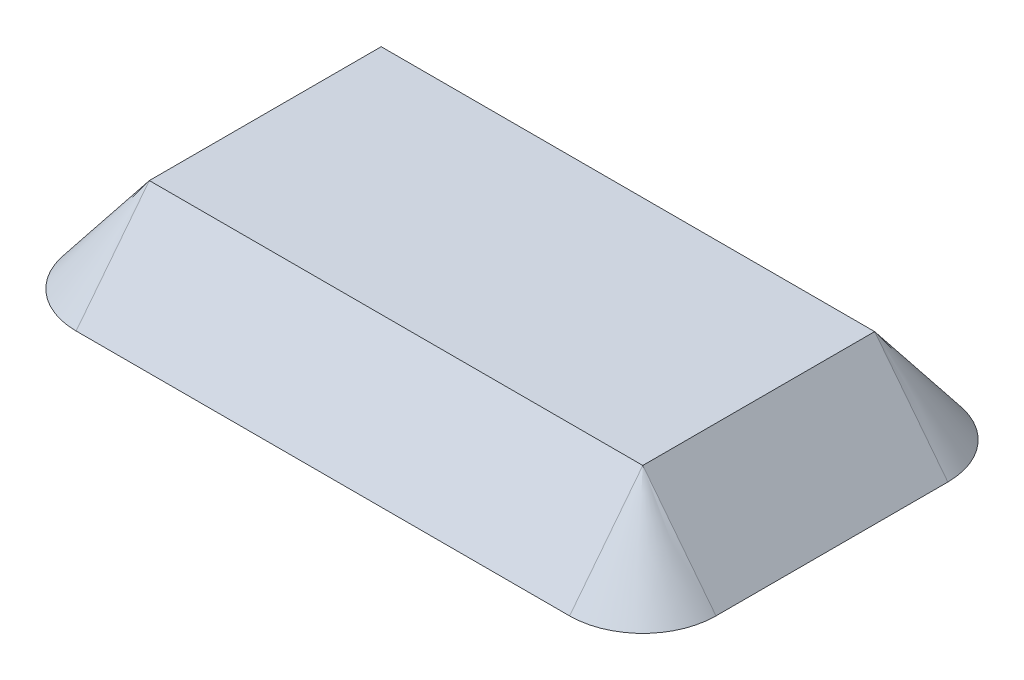
ISO-10303-21;
HEADER;
FILE_DESCRIPTION(('STEP AP214'),'2;1');
FILE_NAME('part.step','',(''),(''),'','','');
FILE_SCHEMA(('AUTOMOTIVE_DESIGN { 1 0 10303 214 1 1 1 1 }'));
ENDSEC;
DATA;
#1=APPLICATION_CONTEXT('core data for automotive mechanical design processes');
#2=APPLICATION_PROTOCOL_DEFINITION('international standard','automotive_design',2000,#1);
#3=PRODUCT_CONTEXT('',#1,'mechanical');
#4=PRODUCT('Part','Part','',(#3));
#5=PRODUCT_RELATED_PRODUCT_CATEGORY('part','',(#4));
#6=PRODUCT_DEFINITION_FORMATION('','',#4);
#7=PRODUCT_DEFINITION_CONTEXT('part definition',#1,'design');
#8=PRODUCT_DEFINITION('design','',#6,#7);
#9=PRODUCT_DEFINITION_SHAPE('','',#8);
#10=(LENGTH_UNIT() NAMED_UNIT(*) SI_UNIT(.MILLI.,.METRE.));
#11=(NAMED_UNIT(*) PLANE_ANGLE_UNIT() SI_UNIT($,.RADIAN.));
#12=(NAMED_UNIT(*) SI_UNIT($,.STERADIAN.) SOLID_ANGLE_UNIT());
#13=UNCERTAINTY_MEASURE_WITH_UNIT(LENGTH_MEASURE(1.E-05),#10,'distance_accuracy_value','');
#14=(GEOMETRIC_REPRESENTATION_CONTEXT(3) GLOBAL_UNCERTAINTY_ASSIGNED_CONTEXT((#13)) GLOBAL_UNIT_ASSIGNED_CONTEXT((#10,
#11,#12)) REPRESENTATION_CONTEXT('',''));
#15=CARTESIAN_POINT('',(0.,0.,0.));
#16=DIRECTION('',(0.,0.,1.));
#17=DIRECTION('',(1.,0.,0.));
#18=AXIS2_PLACEMENT_3D('',#15,#16,#17);
#19=CARTESIAN_POINT('',(0.,0.,0.));
#20=DIRECTION('',(0.,-1.,0.));
#21=DIRECTION('',(0.,0.,-1.));
#22=AXIS2_PLACEMENT_3D('',#19,#20,#21);
#23=PLANE('',#22);
#24=DIRECTION('',(0.,0.,-1.));
#25=VECTOR('',#24,1.);
#26=CARTESIAN_POINT('',(102.25,0.,-47.25));
#27=LINE('',#26,#25);
#28=CARTESIAN_POINT('',(102.25,0.,47.25));
#29=VERTEX_POINT('',#28);
#30=CARTESIAN_POINT('',(102.25,0.,10.));
#31=VERTEX_POINT('',#30);
#32=EDGE_CURVE('E537',#29,#31,#27,.T.);
#33=ORIENTED_EDGE('',*,*,#32,.T.);
#34=DIRECTION('',(1.,0.,0.));
#35=VECTOR('',#34,1.);
#36=CARTESIAN_POINT('',(0.,0.,10.));
#37=LINE('',#36,#35);
#38=CARTESIAN_POINT('',(103.75,0.,10.));
#39=VERTEX_POINT('',#38);
#40=EDGE_CURVE('E50',#31,#39,#37,.T.);
#41=ORIENTED_EDGE('',*,*,#40,.T.);
#42=DIRECTION('',(0.,0.,-1.));
#43=VECTOR('',#42,1.);
#44=CARTESIAN_POINT('',(103.75,0.,-48.75));
#45=LINE('',#44,#43);
#46=CARTESIAN_POINT('',(103.75,0.,48.75));
#47=VERTEX_POINT('',#46);
#48=EDGE_CURVE('E566',#47,#39,#45,.T.);
#49=ORIENTED_EDGE('',*,*,#48,.F.);
#50=DIRECTION('',(1.,0.,0.));
#51=VECTOR('',#50,1.);
#52=CARTESIAN_POINT('',(103.75,0.,48.75));
#53=LINE('',#52,#51);
#54=CARTESIAN_POINT('',(-103.75,0.,48.75));
#55=VERTEX_POINT('',#54);
#56=EDGE_CURVE('E561',#55,#47,#53,.T.);
#57=ORIENTED_EDGE('',*,*,#56,.F.);
#58=DIRECTION('',(0.,0.,1.));
#59=VECTOR('',#58,1.);
#60=CARTESIAN_POINT('',(-103.75,0.,-48.75));
#61=LINE('',#60,#59);
#62=CARTESIAN_POINT('',(-103.75,0.,10.));
#63=VERTEX_POINT('',#62);
#64=EDGE_CURVE('E556',#63,#55,#61,.T.);
#65=ORIENTED_EDGE('',*,*,#64,.F.);
#66=DIRECTION('',(-1.,0.,0.));
#67=VECTOR('',#66,1.);
#68=CARTESIAN_POINT('',(0.,0.,10.));
#69=LINE('',#68,#67);
#70=CARTESIAN_POINT('',(-102.25,0.,10.));
#71=VERTEX_POINT('',#70);
#72=EDGE_CURVE('E64',#71,#63,#69,.T.);
#73=ORIENTED_EDGE('',*,*,#72,.F.);
#74=DIRECTION('',(0.,0.,1.));
#75=VECTOR('',#74,1.);
#76=CARTESIAN_POINT('',(-102.25,0.,-47.25));
#77=LINE('',#76,#75);
#78=CARTESIAN_POINT('',(-102.25,0.,47.25));
#79=VERTEX_POINT('',#78);
#80=EDGE_CURVE('E519',#71,#79,#77,.T.);
#81=ORIENTED_EDGE('',*,*,#80,.T.);
#82=DIRECTION('',(1.,0.,0.));
#83=VECTOR('',#82,1.);
#84=CARTESIAN_POINT('',(102.25,0.,47.25));
#85=LINE('',#84,#83);
#86=EDGE_CURVE('E532',#79,#29,#85,.T.);
#87=ORIENTED_EDGE('',*,*,#86,.T.);
#88=EDGE_LOOP('',(#33,#41,#49,#57,#65,#73,#81,#87));
#89=FACE_BOUND('',#88,.T.);
#90=ADVANCED_FACE('F41',(#89),#23,.T.);
#91=CARTESIAN_POINT('',(-102.25,25.,-47.25));
#92=DIRECTION('',(1.,0.,0.));
#93=DIRECTION('',(0.,0.,-1.));
#94=AXIS2_PLACEMENT_3D('',#91,#92,#93);
#95=PLANE('',#94);
#96=DIRECTION('',(0.,1.,0.));
#97=VECTOR('',#96,1.);
#98=CARTESIAN_POINT('',(-102.25,10.,10.));
#99=LINE('',#98,#97);
#100=CARTESIAN_POINT('',(-102.25,-10.,10.));
#101=VERTEX_POINT('',#100);
#102=EDGE_CURVE('E299',#101,#71,#99,.T.);
#103=ORIENTED_EDGE('',*,*,#102,.F.);
#104=CARTESIAN_POINT('',(-102.25,-10.,0.));
#105=DIRECTION('',(1.,0.,0.));
#106=DIRECTION('',(0.,0.,-1.));
#107=AXIS2_PLACEMENT_3D('',#104,#105,#106);
#108=CIRCLE('',#107,10.);
#109=CARTESIAN_POINT('',(-102.25,-10.,-9.99999999999999));
#110=VERTEX_POINT('',#109);
#111=EDGE_CURVE('E288',#101,#110,#108,.F.);
#112=ORIENTED_EDGE('',*,*,#111,.T.);
#113=DIRECTION('',(0.,-1.,0.));
#114=VECTOR('',#113,1.);
#115=CARTESIAN_POINT('',(-102.25,10.,-9.99999999999999));
#116=LINE('',#115,#114);
#117=CARTESIAN_POINT('',(-102.25,0.,-9.99999999999999));
#118=VERTEX_POINT('',#117);
#119=EDGE_CURVE('E295',#118,#110,#116,.T.);
#120=ORIENTED_EDGE('',*,*,#119,.F.);
#121=CARTESIAN_POINT('',(-102.25,0.,-47.25));
#122=VERTEX_POINT('',#121);
#123=EDGE_CURVE('E529',#122,#118,#77,.T.);
#124=ORIENTED_EDGE('',*,*,#123,.F.);
#125=DIRECTION('',(0.,-1.,0.));
#126=VECTOR('',#125,1.);
#127=CARTESIAN_POINT('',(-102.25,25.,-47.25));
#128=LINE('',#127,#126);
#129=CARTESIAN_POINT('',(-102.25,5.99999999999999,-47.25));
#130=VERTEX_POINT('',#129);
#131=EDGE_CURVE('E528',#130,#122,#128,.T.);
#132=ORIENTED_EDGE('',*,*,#131,.F.);
#133=DIRECTION('',(0.,0.,-1.));
#134=VECTOR('',#133,1.);
#135=CARTESIAN_POINT('',(-102.25,5.99999999999999,0.));
#136=LINE('',#135,#134);
#137=CARTESIAN_POINT('',(-102.25,5.99999999999999,-44.75));
#138=VERTEX_POINT('',#137);
#139=EDGE_CURVE('E325',#138,#130,#136,.T.);
#140=ORIENTED_EDGE('',*,*,#139,.F.);
#141=DIRECTION('',(0.,-1.,0.));
#142=VECTOR('',#141,1.);
#143=CARTESIAN_POINT('',(-102.25,0.,-44.75));
#144=LINE('',#143,#142);
#145=CARTESIAN_POINT('',(-102.25,25.,-44.75));
#146=VERTEX_POINT('',#145);
#147=EDGE_CURVE('E321',#146,#138,#144,.T.);
#148=ORIENTED_EDGE('',*,*,#147,.F.);
#149=DIRECTION('',(0.,0.,1.));
#150=VECTOR('',#149,1.);
#151=CARTESIAN_POINT('',(-102.25,25.,-47.25));
#152=LINE('',#151,#150);
#153=CARTESIAN_POINT('',(-102.25,25.,44.75));
#154=VERTEX_POINT('',#153);
#155=EDGE_CURVE('E520',#146,#154,#152,.T.);
#156=ORIENTED_EDGE('',*,*,#155,.T.);
#157=DIRECTION('',(0.,-1.,0.));
#158=VECTOR('',#157,1.);
#159=CARTESIAN_POINT('',(-102.25,0.,44.7499999999999));
#160=LINE('',#159,#158);
#161=CARTESIAN_POINT('',(-102.25,5.99999999999999,44.75));
#162=VERTEX_POINT('',#161);
#163=EDGE_CURVE('E348',#154,#162,#160,.T.);
#164=ORIENTED_EDGE('',*,*,#163,.T.);
#165=DIRECTION('',(0.,0.,1.));
#166=VECTOR('',#165,1.);
#167=CARTESIAN_POINT('',(-102.25,5.99999999999999,0.));
#168=LINE('',#167,#166);
#169=CARTESIAN_POINT('',(-102.25,5.99999999999999,47.25));
#170=VERTEX_POINT('',#169);
#171=EDGE_CURVE('E345',#162,#170,#168,.T.);
#172=ORIENTED_EDGE('',*,*,#171,.T.);
#173=DIRECTION('',(0.,-1.,0.));
#174=VECTOR('',#173,1.);
#175=CARTESIAN_POINT('',(-102.25,25.,47.25));
#176=LINE('',#175,#174);
#177=EDGE_CURVE('E552',#170,#79,#176,.T.);
#178=ORIENTED_EDGE('',*,*,#177,.T.);
#179=ORIENTED_EDGE('',*,*,#80,.F.);
#180=EDGE_LOOP('',(#103,#112,#120,#124,#132,#140,#148,#156,#164,#172,#178,#179));
#181=FACE_BOUND('',#180,.T.);
#182=ADVANCED_FACE('F612',(#181),#95,.T.);
#183=CARTESIAN_POINT('',(102.25,25.,-47.25));
#184=DIRECTION('',(-1.,0.,0.));
#185=DIRECTION('',(0.,0.,1.));
#186=AXIS2_PLACEMENT_3D('',#183,#184,#185);
#187=PLANE('',#186);
#188=DIRECTION('',(0.,-1.,0.));
#189=VECTOR('',#188,1.);
#190=CARTESIAN_POINT('',(102.25,0.,-10.0000000000001));
#191=LINE('',#190,#189);
#192=CARTESIAN_POINT('',(102.25,0.,-10.0000000000001));
#193=VERTEX_POINT('',#192);
#194=CARTESIAN_POINT('',(102.25,-10.,-10.0000000000001));
#195=VERTEX_POINT('',#194);
#196=EDGE_CURVE('E259',#193,#195,#191,.T.);
#197=ORIENTED_EDGE('',*,*,#196,.T.);
#198=CARTESIAN_POINT('',(102.25,-10.,0.));
#199=DIRECTION('',(-1.,0.,0.));
#200=DIRECTION('',(0.,0.,1.));
#201=AXIS2_PLACEMENT_3D('',#198,#199,#200);
#202=CIRCLE('',#201,10.);
#203=CARTESIAN_POINT('',(102.25,-10.,10.));
#204=VERTEX_POINT('',#203);
#205=EDGE_CURVE('E245',#204,#195,#202,.T.);
#206=ORIENTED_EDGE('',*,*,#205,.F.);
#207=DIRECTION('',(0.,-1.,0.));
#208=VECTOR('',#207,1.);
#209=CARTESIAN_POINT('',(102.25,0.,10.));
#210=LINE('',#209,#208);
#211=EDGE_CURVE('E252',#31,#204,#210,.T.);
#212=ORIENTED_EDGE('',*,*,#211,.F.);
#213=ORIENTED_EDGE('',*,*,#32,.F.);
#214=DIRECTION('',(0.,-1.,0.));
#215=VECTOR('',#214,1.);
#216=CARTESIAN_POINT('',(102.25,25.,47.25));
#217=LINE('',#216,#215);
#218=CARTESIAN_POINT('',(102.25,5.99999999999999,47.25));
#219=VERTEX_POINT('',#218);
#220=EDGE_CURVE('E549',#219,#29,#217,.T.);
#221=ORIENTED_EDGE('',*,*,#220,.F.);
#222=DIRECTION('',(0.,0.,-1.));
#223=VECTOR('',#222,1.);
#224=CARTESIAN_POINT('',(102.25,5.99999999999999,0.));
#225=LINE('',#224,#223);
#226=CARTESIAN_POINT('',(102.25,5.99999999999999,44.75));
#227=VERTEX_POINT('',#226);
#228=EDGE_CURVE('E356',#219,#227,#225,.T.);
#229=ORIENTED_EDGE('',*,*,#228,.T.);
#230=DIRECTION('',(0.,1.,0.));
#231=VECTOR('',#230,1.);
#232=CARTESIAN_POINT('',(102.25,0.,44.75));
#233=LINE('',#232,#231);
#234=CARTESIAN_POINT('',(102.25,25.,44.75));
#235=VERTEX_POINT('',#234);
#236=EDGE_CURVE('E329',#227,#235,#233,.T.);
#237=ORIENTED_EDGE('',*,*,#236,.T.);
#238=DIRECTION('',(0.,0.,-1.));
#239=VECTOR('',#238,1.);
#240=CARTESIAN_POINT('',(102.25,25.,-47.25));
#241=LINE('',#240,#239);
#242=CARTESIAN_POINT('',(102.25,25.,-44.75));
#243=VERTEX_POINT('',#242);
#244=EDGE_CURVE('E523',#235,#243,#241,.T.);
#245=ORIENTED_EDGE('',*,*,#244,.T.);
#246=DIRECTION('',(0.,1.,0.));
#247=VECTOR('',#246,1.);
#248=CARTESIAN_POINT('',(102.25,0.,-44.75));
#249=LINE('',#248,#247);
#250=CARTESIAN_POINT('',(102.25,5.99999999999999,-44.75));
#251=VERTEX_POINT('',#250);
#252=EDGE_CURVE('E333',#251,#243,#249,.T.);
#253=ORIENTED_EDGE('',*,*,#252,.F.);
#254=DIRECTION('',(0.,0.,1.));
#255=VECTOR('',#254,1.);
#256=CARTESIAN_POINT('',(102.25,5.99999999999999,0.));
#257=LINE('',#256,#255);
#258=CARTESIAN_POINT('',(102.25,5.99999999999999,-47.25));
#259=VERTEX_POINT('',#258);
#260=EDGE_CURVE('E320',#259,#251,#257,.T.);
#261=ORIENTED_EDGE('',*,*,#260,.F.);
#262=DIRECTION('',(0.,-1.,0.));
#263=VECTOR('',#262,1.);
#264=CARTESIAN_POINT('',(102.25,25.,-47.25));
#265=LINE('',#264,#263);
#266=CARTESIAN_POINT('',(102.25,0.,-47.25));
#267=VERTEX_POINT('',#266);
#268=EDGE_CURVE('E545',#259,#267,#265,.T.);
#269=ORIENTED_EDGE('',*,*,#268,.T.);
#270=EDGE_CURVE('E536',#193,#267,#27,.T.);
#271=ORIENTED_EDGE('',*,*,#270,.F.);
#272=EDGE_LOOP('',(#197,#206,#212,#213,#221,#229,#237,#245,#253,#261,#269,#271));
#273=FACE_BOUND('',#272,.T.);
#274=ADVANCED_FACE('F261',(#273),#187,.T.);
#275=CARTESIAN_POINT('',(102.25,25.,-47.25));
#276=DIRECTION('',(0.,0.,1.));
#277=DIRECTION('',(1.,0.,0.));
#278=AXIS2_PLACEMENT_3D('',#275,#276,#277);
#279=PLANE('',#278);
#280=ORIENTED_EDGE('',*,*,#268,.F.);
#281=DIRECTION('',(1.,0.,0.));
#282=VECTOR('',#281,1.);
#283=CARTESIAN_POINT('',(-121.413767896737,5.99999999999999,-47.25));
#284=LINE('',#283,#282);
#285=EDGE_CURVE('E336',#130,#259,#284,.T.);
#286=ORIENTED_EDGE('',*,*,#285,.F.);
#287=ORIENTED_EDGE('',*,*,#131,.T.);
#288=DIRECTION('',(-1.,0.,0.));
#289=VECTOR('',#288,1.);
#290=CARTESIAN_POINT('',(102.25,0.,-47.25));
#291=LINE('',#290,#289);
#292=EDGE_CURVE('E524',#267,#122,#291,.T.);
#293=ORIENTED_EDGE('',*,*,#292,.F.);
#294=EDGE_LOOP('',(#280,#286,#287,#293));
#295=FACE_BOUND('',#294,.T.);
#296=ADVANCED_FACE('F660',(#295),#279,.T.);
#297=CARTESIAN_POINT('',(0.,25.,0.));
#298=DIRECTION('',(0.,-1.,0.));
#299=DIRECTION('',(0.,0.,-1.));
#300=AXIS2_PLACEMENT_3D('',#297,#298,#299);
#301=PLANE('',#300);
#302=ORIENTED_EDGE('',*,*,#155,.F.);
#303=DIRECTION('',(1.,0.,0.));
#304=VECTOR('',#303,1.);
#305=CARTESIAN_POINT('',(-121.413767896737,25.,-44.7500000000001));
#306=LINE('',#305,#304);
#307=EDGE_CURVE('E339',#146,#243,#306,.T.);
#308=ORIENTED_EDGE('',*,*,#307,.T.);
#309=ORIENTED_EDGE('',*,*,#244,.F.);
#310=DIRECTION('',(1.,0.,0.));
#311=VECTOR('',#310,1.);
#312=CARTESIAN_POINT('',(-121.413767896737,25.,44.7499999999999));
#313=LINE('',#312,#311);
#314=EDGE_CURVE('E359',#154,#235,#313,.T.);
#315=ORIENTED_EDGE('',*,*,#314,.F.);
#316=EDGE_LOOP('',(#302,#308,#309,#315));
#317=FACE_BOUND('',#316,.T.);
#318=ADVANCED_FACE('F649',(#317),#301,.T.);
#319=CARTESIAN_POINT('',(103.75,25.,-48.75));
#320=DIRECTION('',(-1.,0.,0.));
#321=DIRECTION('',(0.,0.,1.));
#322=AXIS2_PLACEMENT_3D('',#319,#320,#321);
#323=PLANE('',#322);
#324=DIRECTION('',(0.,1.,0.));
#325=VECTOR('',#324,1.);
#326=CARTESIAN_POINT('',(103.75,0.,-10.0000000000001));
#327=LINE('',#326,#325);
#328=CARTESIAN_POINT('',(103.75,-10.,-10.0000000000001));
#329=VERTEX_POINT('',#328);
#330=CARTESIAN_POINT('',(103.75,0.,-10.0000000000001));
#331=VERTEX_POINT('',#330);
#332=EDGE_CURVE('E57',#329,#331,#327,.T.);
#333=ORIENTED_EDGE('',*,*,#332,.T.);
#334=CARTESIAN_POINT('',(103.75,0.,-48.75));
#335=VERTEX_POINT('',#334);
#336=EDGE_CURVE('E565',#331,#335,#45,.T.);
#337=ORIENTED_EDGE('',*,*,#336,.T.);
#338=DIRECTION('',(0.,-1.,0.));
#339=VECTOR('',#338,1.);
#340=CARTESIAN_POINT('',(103.75,25.,-48.75));
#341=LINE('',#340,#339);
#342=CARTESIAN_POINT('',(103.75,26.0800875517104,-48.75));
#343=VERTEX_POINT('',#342);
#344=EDGE_CURVE('E577',#343,#335,#341,.T.);
#345=ORIENTED_EDGE('',*,*,#344,.F.);
#346=DIRECTION('',(0.,0.,1.));
#347=VECTOR('',#346,1.);
#348=CARTESIAN_POINT('',(103.75,26.0800875517104,-98.75));
#349=LINE('',#348,#347);
#350=CARTESIAN_POINT('',(103.75,26.0800875517104,48.75));
#351=VERTEX_POINT('',#350);
#352=EDGE_CURVE('E352',#343,#351,#349,.T.);
#353=ORIENTED_EDGE('',*,*,#352,.T.);
#354=DIRECTION('',(0.,-1.,0.));
#355=VECTOR('',#354,1.);
#356=CARTESIAN_POINT('',(103.75,25.,48.75));
#357=LINE('',#356,#355);
#358=EDGE_CURVE('E581',#351,#47,#357,.T.);
#359=ORIENTED_EDGE('',*,*,#358,.T.);
#360=ORIENTED_EDGE('',*,*,#48,.T.);
#361=DIRECTION('',(0.,1.,0.));
#362=VECTOR('',#361,1.);
#363=CARTESIAN_POINT('',(103.75,0.,10.));
#364=LINE('',#363,#362);
#365=CARTESIAN_POINT('',(103.75,-10.,10.));
#366=VERTEX_POINT('',#365);
#367=EDGE_CURVE('E277',#366,#39,#364,.T.);
#368=ORIENTED_EDGE('',*,*,#367,.F.);
#369=CARTESIAN_POINT('',(103.75,-10.,0.));
#370=DIRECTION('',(-1.,0.,0.));
#371=DIRECTION('',(0.,0.,1.));
#372=AXIS2_PLACEMENT_3D('',#369,#370,#371);
#373=CIRCLE('',#372,10.);
#374=EDGE_CURVE('E246',#366,#329,#373,.F.);
#375=ORIENTED_EDGE('',*,*,#374,.T.);
#376=EDGE_LOOP('',(#333,#337,#345,#353,#359,#360,#368,#375));
#377=FACE_BOUND('',#376,.T.);
#378=ADVANCED_FACE('F590',(#377),#323,.F.);
#379=CARTESIAN_POINT('',(103.75,25.,-48.75));
#380=DIRECTION('',(0.,0.,1.));
#381=DIRECTION('',(1.,0.,0.));
#382=AXIS2_PLACEMENT_3D('',#379,#380,#381);
#383=PLANE('',#382);
#384=DIRECTION('',(-1.,0.,0.));
#385=VECTOR('',#384,1.);
#386=CARTESIAN_POINT('',(153.75,26.0800875517104,-48.7500000000001));
#387=LINE('',#386,#385);
#388=CARTESIAN_POINT('',(-103.75,26.0800875517104,-48.75));
#389=VERTEX_POINT('',#388);
#390=EDGE_CURVE('E459',#343,#389,#387,.T.);
#391=ORIENTED_EDGE('',*,*,#390,.F.);
#392=ORIENTED_EDGE('',*,*,#344,.T.);
#393=DIRECTION('',(-1.,0.,0.));
#394=VECTOR('',#393,1.);
#395=CARTESIAN_POINT('',(103.75,0.,-48.75));
#396=LINE('',#395,#394);
#397=CARTESIAN_POINT('',(-103.75,0.,-48.75));
#398=VERTEX_POINT('',#397);
#399=EDGE_CURVE('E570',#335,#398,#396,.T.);
#400=ORIENTED_EDGE('',*,*,#399,.T.);
#401=DIRECTION('',(0.,-1.,0.));
#402=VECTOR('',#401,1.);
#403=CARTESIAN_POINT('',(-103.75,25.,-48.75));
#404=LINE('',#403,#402);
#405=EDGE_CURVE('E574',#389,#398,#404,.T.);
#406=ORIENTED_EDGE('',*,*,#405,.F.);
#407=EDGE_LOOP('',(#391,#392,#400,#406));
#408=FACE_BOUND('',#407,.T.);
#409=ADVANCED_FACE('F624',(#408),#383,.F.);
#410=DIRECTION('',(1.,0.,0.));
#411=VECTOR('',#410,1.);
#412=CARTESIAN_POINT('',(0.,0.,-10.0000000000001));
#413=LINE('',#412,#411);
#414=EDGE_CURVE('E11',#193,#331,#413,.T.);
#415=ORIENTED_EDGE('',*,*,#414,.F.);
#416=ORIENTED_EDGE('',*,*,#270,.T.);
#417=ORIENTED_EDGE('',*,*,#292,.T.);
#418=ORIENTED_EDGE('',*,*,#123,.T.);
#419=DIRECTION('',(1.,0.,0.));
#420=VECTOR('',#419,1.);
#421=CARTESIAN_POINT('',(0.,0.,-10.));
#422=LINE('',#421,#420);
#423=CARTESIAN_POINT('',(-103.75,0.,-9.99999999999999));
#424=VERTEX_POINT('',#423);
#425=EDGE_CURVE('E316',#424,#118,#422,.T.);
#426=ORIENTED_EDGE('',*,*,#425,.F.);
#427=EDGE_CURVE('E557',#398,#424,#61,.T.);
#428=ORIENTED_EDGE('',*,*,#427,.F.);
#429=ORIENTED_EDGE('',*,*,#399,.F.);
#430=ORIENTED_EDGE('',*,*,#336,.F.);
#431=EDGE_LOOP('',(#415,#416,#417,#418,#426,#428,#429,#430));
#432=FACE_BOUND('',#431,.T.);
#433=ADVANCED_FACE('F619',(#432),#23,.T.);
#434=CARTESIAN_POINT('',(-103.75,25.,-48.75));
#435=DIRECTION('',(1.,0.,0.));
#436=DIRECTION('',(0.,0.,-1.));
#437=AXIS2_PLACEMENT_3D('',#434,#435,#436);
#438=PLANE('',#437);
#439=DIRECTION('',(0.,-1.,0.));
#440=VECTOR('',#439,1.);
#441=CARTESIAN_POINT('',(-103.75,10.,-9.99999999999999));
#442=LINE('',#441,#440);
#443=CARTESIAN_POINT('',(-103.75,-10.,-9.99999999999999));
#444=VERTEX_POINT('',#443);
#445=EDGE_CURVE('E292',#424,#444,#442,.T.);
#446=ORIENTED_EDGE('',*,*,#445,.T.);
#447=CARTESIAN_POINT('',(-103.75,-10.,0.));
#448=DIRECTION('',(1.,0.,0.));
#449=DIRECTION('',(0.,0.,-1.));
#450=AXIS2_PLACEMENT_3D('',#447,#448,#449);
#451=CIRCLE('',#450,10.);
#452=CARTESIAN_POINT('',(-103.75,-10.,10.));
#453=VERTEX_POINT('',#452);
#454=EDGE_CURVE('E279',#453,#444,#451,.T.);
#455=ORIENTED_EDGE('',*,*,#454,.F.);
#456=DIRECTION('',(0.,1.,0.));
#457=VECTOR('',#456,1.);
#458=CARTESIAN_POINT('',(-103.75,10.,10.));
#459=LINE('',#458,#457);
#460=EDGE_CURVE('E291',#453,#63,#459,.T.);
#461=ORIENTED_EDGE('',*,*,#460,.T.);
#462=ORIENTED_EDGE('',*,*,#64,.T.);
#463=DIRECTION('',(0.,-1.,0.));
#464=VECTOR('',#463,1.);
#465=CARTESIAN_POINT('',(-103.75,25.,48.75));
#466=LINE('',#465,#464);
#467=CARTESIAN_POINT('',(-103.75,26.0800875517104,48.75));
#468=VERTEX_POINT('',#467);
#469=EDGE_CURVE('E584',#468,#55,#466,.T.);
#470=ORIENTED_EDGE('',*,*,#469,.F.);
#471=DIRECTION('',(0.,0.,-1.));
#472=VECTOR('',#471,1.);
#473=CARTESIAN_POINT('',(-103.75,26.0800875517104,-48.75));
#474=LINE('',#473,#472);
#475=EDGE_CURVE('E449',#468,#389,#474,.T.);
#476=ORIENTED_EDGE('',*,*,#475,.T.);
#477=ORIENTED_EDGE('',*,*,#405,.T.);
#478=ORIENTED_EDGE('',*,*,#427,.T.);
#479=EDGE_LOOP('',(#446,#455,#461,#462,#470,#476,#477,#478));
#480=FACE_BOUND('',#479,.T.);
#481=ADVANCED_FACE('F43',(#480),#438,.F.);
#482=CARTESIAN_POINT('',(103.75,25.,48.75));
#483=DIRECTION('',(0.,0.,-1.));
#484=DIRECTION('',(-1.,0.,0.));
#485=AXIS2_PLACEMENT_3D('',#482,#483,#484);
#486=PLANE('',#485);
#487=ORIENTED_EDGE('',*,*,#358,.F.);
#488=DIRECTION('',(-1.,0.,0.));
#489=VECTOR('',#488,1.);
#490=CARTESIAN_POINT('',(153.75,26.0800875517104,48.75));
#491=LINE('',#490,#489);
#492=EDGE_CURVE('E493',#351,#468,#491,.T.);
#493=ORIENTED_EDGE('',*,*,#492,.T.);
#494=ORIENTED_EDGE('',*,*,#469,.T.);
#495=ORIENTED_EDGE('',*,*,#56,.T.);
#496=EDGE_LOOP('',(#487,#493,#494,#495));
#497=FACE_BOUND('',#496,.T.);
#498=ADVANCED_FACE('F596',(#497),#486,.F.);
#499=CARTESIAN_POINT('',(102.25,25.,47.25));
#500=DIRECTION('',(0.,0.,-1.));
#501=DIRECTION('',(-1.,0.,0.));
#502=AXIS2_PLACEMENT_3D('',#499,#500,#501);
#503=PLANE('',#502);
#504=DIRECTION('',(1.,0.,0.));
#505=VECTOR('',#504,1.);
#506=CARTESIAN_POINT('',(-121.413767896737,5.99999999999999,47.2499999999999));
#507=LINE('',#506,#505);
#508=EDGE_CURVE('E363',#170,#219,#507,.T.);
#509=ORIENTED_EDGE('',*,*,#508,.T.);
#510=ORIENTED_EDGE('',*,*,#220,.T.);
#511=ORIENTED_EDGE('',*,*,#86,.F.);
#512=ORIENTED_EDGE('',*,*,#177,.F.);
#513=EDGE_LOOP('',(#509,#510,#511,#512));
#514=FACE_BOUND('',#513,.T.);
#515=ADVANCED_FACE('F634',(#514),#503,.T.);
#516=CARTESIAN_POINT('',(0.,28.,0.));
#517=DIRECTION('',(0.,-1.,0.));
#518=DIRECTION('',(0.,0.,-1.));
#519=AXIS2_PLACEMENT_3D('',#516,#517,#518);
#520=PLANE('',#519);
#521=DIRECTION('',(-1.,0.,0.));
#522=VECTOR('',#521,1.);
#523=CARTESIAN_POINT('',(-103.75,28.,-48.75));
#524=LINE('',#523,#522);
#525=CARTESIAN_POINT('',(103.75,28.,-48.75));
#526=VERTEX_POINT('',#525);
#527=CARTESIAN_POINT('',(-103.75,28.,-48.75));
#528=VERTEX_POINT('',#527);
#529=EDGE_CURVE('E515',#526,#528,#524,.T.);
#530=ORIENTED_EDGE('',*,*,#529,.T.);
#531=DIRECTION('',(0.,0.,1.));
#532=VECTOR('',#531,1.);
#533=CARTESIAN_POINT('',(-103.75,28.,48.75));
#534=LINE('',#533,#532);
#535=CARTESIAN_POINT('',(-103.75,28.,48.75));
#536=VERTEX_POINT('',#535);
#537=EDGE_CURVE('E505',#528,#536,#534,.T.);
#538=ORIENTED_EDGE('',*,*,#537,.T.);
#539=DIRECTION('',(1.,0.,0.));
#540=VECTOR('',#539,1.);
#541=CARTESIAN_POINT('',(-103.75,28.,48.75));
#542=LINE('',#541,#540);
#543=CARTESIAN_POINT('',(103.75,28.,48.75));
#544=VERTEX_POINT('',#543);
#545=EDGE_CURVE('E509',#536,#544,#542,.T.);
#546=ORIENTED_EDGE('',*,*,#545,.T.);
#547=DIRECTION('',(0.,0.,-1.));
#548=VECTOR('',#547,1.);
#549=CARTESIAN_POINT('',(103.75,28.,48.75));
#550=LINE('',#549,#548);
#551=EDGE_CURVE('E512',#544,#526,#550,.T.);
#552=ORIENTED_EDGE('',*,*,#551,.T.);
#553=EDGE_LOOP('',(#530,#538,#546,#552));
#554=FACE_BOUND('',#553,.T.);
#555=ADVANCED_FACE('F690',(#554),#520,.F.);
#556=CARTESIAN_POINT('',(153.75,28.,48.75));
#557=DIRECTION('',(0.,0.615661475325659,0.788010753606721));
#558=DIRECTION('',(0.,-0.788010753606721,0.615661475325659));
#559=AXIS2_PLACEMENT_3D('',#556,#557,#558);
#560=PLANE('',#559);
#561=DIRECTION('',(0.,-0.788010753606721,0.615661475325659));
#562=VECTOR('',#561,1.);
#563=CARTESIAN_POINT('',(103.75,28.,48.75));
#564=LINE('',#563,#562);
#565=CARTESIAN_POINT('',(103.75,-11.400537680336,79.533073766283));
#566=VERTEX_POINT('',#565);
#567=EDGE_CURVE('E480',#544,#566,#564,.T.);
#568=ORIENTED_EDGE('',*,*,#567,.F.);
#569=ORIENTED_EDGE('',*,*,#545,.F.);
#570=DIRECTION('',(0.,0.788010753606721,-0.615661475325659));
#571=VECTOR('',#570,1.);
#572=CARTESIAN_POINT('',(-103.75,28.,48.75));
#573=LINE('',#572,#571);
#574=CARTESIAN_POINT('',(-103.75,-11.400537680336,79.533073766283));
#575=VERTEX_POINT('',#574);
#576=EDGE_CURVE('E489',#575,#536,#573,.T.);
#577=ORIENTED_EDGE('',*,*,#576,.F.);
#578=DIRECTION('',(-1.,0.,0.));
#579=VECTOR('',#578,1.);
#580=CARTESIAN_POINT('',(153.75,-11.400537680336,79.5330737662829));
#581=LINE('',#580,#579);
#582=EDGE_CURVE('E485',#566,#575,#581,.T.);
#583=ORIENTED_EDGE('',*,*,#582,.F.);
#584=EDGE_LOOP('',(#568,#569,#577,#583));
#585=FACE_BOUND('',#584,.T.);
#586=ADVANCED_FACE('F695',(#585),#560,.T.);
#587=CARTESIAN_POINT('',(153.75,-11.400537680336,79.5330737662829));
#588=DIRECTION('',(0.,-1.,0.));
#589=DIRECTION('',(0.,0.,-1.));
#590=AXIS2_PLACEMENT_3D('',#587,#588,#589);
#591=PLANE('',#590);
#592=CARTESIAN_POINT('',(103.75,-11.4005376803362,-48.75));
#593=DIRECTION('',(0.,1.,0.));
#594=DIRECTION('',(0.,0.,1.));
#595=AXIS2_PLACEMENT_3D('',#592,#593,#594);
#596=CIRCLE('',#595,30.783073766283);
#597=CARTESIAN_POINT('',(134.533073766283,-11.4005376803362,-48.7499999999999));
#598=VERTEX_POINT('',#597);
#599=CARTESIAN_POINT('',(103.75,-11.4005376803362,-79.533073766283));
#600=VERTEX_POINT('',#599);
#601=EDGE_CURVE('E403',#598,#600,#596,.T.);
#602=ORIENTED_EDGE('',*,*,#601,.F.);
#603=DIRECTION('',(0.,0.,1.));
#604=VECTOR('',#603,1.);
#605=CARTESIAN_POINT('',(134.533073766283,-11.400537680336,-98.7500000000001));
#606=LINE('',#605,#604);
#607=CARTESIAN_POINT('',(134.533073766283,-11.400537680336,48.7499999999999));
#608=VERTEX_POINT('',#607);
#609=EDGE_CURVE('E375',#598,#608,#606,.T.);
#610=ORIENTED_EDGE('',*,*,#609,.T.);
#611=CARTESIAN_POINT('',(103.75,-11.400537680336,48.75));
#612=DIRECTION('',(0.,-1.,0.));
#613=DIRECTION('',(0.,0.,-1.));
#614=AXIS2_PLACEMENT_3D('',#611,#612,#613);
#615=CIRCLE('',#614,30.783073766283);
#616=EDGE_CURVE('E387',#608,#566,#615,.T.);
#617=ORIENTED_EDGE('',*,*,#616,.T.);
#618=ORIENTED_EDGE('',*,*,#582,.T.);
#619=CARTESIAN_POINT('',(-103.749999999999,-11.4005376803354,48.75));
#620=DIRECTION('',(0.,-1.,0.));
#621=DIRECTION('',(1.,0.,0.));
#622=AXIS2_PLACEMENT_3D('',#619,#620,#621);
#623=CIRCLE('',#622,30.7830737662839);
#624=CARTESIAN_POINT('',(-134.533073766283,-11.4005376803361,48.75));
#625=VERTEX_POINT('',#624);
#626=EDGE_CURVE('E419',#575,#625,#623,.T.);
#627=ORIENTED_EDGE('',*,*,#626,.T.);
#628=DIRECTION('',(0.,0.,1.));
#629=VECTOR('',#628,1.);
#630=CARTESIAN_POINT('',(-134.533073766283,-11.4005376803361,-99.687208613143));
#631=LINE('',#630,#629);
#632=CARTESIAN_POINT('',(-134.533073766283,-11.4005376803361,-48.75));
#633=VERTEX_POINT('',#632);
#634=EDGE_CURVE('E441',#633,#625,#631,.T.);
#635=ORIENTED_EDGE('',*,*,#634,.F.);
#636=CARTESIAN_POINT('',(-103.75,-11.4005376803364,-48.7500000000003));
#637=DIRECTION('',(0.,-1.,0.));
#638=DIRECTION('',(0.,0.,-1.));
#639=AXIS2_PLACEMENT_3D('',#636,#637,#638);
#640=CIRCLE('',#639,30.7830737662827);
#641=CARTESIAN_POINT('',(-103.75,-11.4005376803362,-79.533073766283));
#642=VERTEX_POINT('',#641);
#643=EDGE_CURVE('E411',#633,#642,#640,.T.);
#644=ORIENTED_EDGE('',*,*,#643,.T.);
#645=DIRECTION('',(-1.,0.,0.));
#646=VECTOR('',#645,1.);
#647=CARTESIAN_POINT('',(153.75,-11.4005376803362,-79.533073766283));
#648=LINE('',#647,#646);
#649=EDGE_CURVE('E467',#600,#642,#648,.T.);
#650=ORIENTED_EDGE('',*,*,#649,.F.);
#651=EDGE_LOOP('',(#602,#610,#617,#618,#627,#635,#644,#650));
#652=FACE_BOUND('',#651,.T.);
#653=DIRECTION('',(-1.,0.,0.));
#654=VECTOR('',#653,1.);
#655=CARTESIAN_POINT('',(153.75,-11.400537680336,78.0330737662829));
#656=LINE('',#655,#654);
#657=CARTESIAN_POINT('',(103.75,-11.400537680336,78.033073766283));
#658=VERTEX_POINT('',#657);
#659=CARTESIAN_POINT('',(-103.75,-11.400537680336,78.033073766283));
#660=VERTEX_POINT('',#659);
#661=EDGE_CURVE('E496',#658,#660,#656,.T.);
#662=ORIENTED_EDGE('',*,*,#661,.F.);
#663=CARTESIAN_POINT('',(103.75,-11.400537680336,48.75));
#664=DIRECTION('',(0.,-1.,0.));
#665=DIRECTION('',(0.,0.,-1.));
#666=AXIS2_PLACEMENT_3D('',#663,#664,#665);
#667=CIRCLE('',#666,29.283073766283);
#668=CARTESIAN_POINT('',(133.033073766283,-11.400537680336,48.7499999999999));
#669=VERTEX_POINT('',#668);
#670=EDGE_CURVE('E391',#669,#658,#667,.T.);
#671=ORIENTED_EDGE('',*,*,#670,.F.);
#672=DIRECTION('',(0.,0.,1.));
#673=VECTOR('',#672,1.);
#674=CARTESIAN_POINT('',(133.033073766282,-11.400537680336,-98.7500000000001));
#675=LINE('',#674,#673);
#676=CARTESIAN_POINT('',(133.033073766283,-11.4005376803361,-48.7499999999999));
#677=VERTEX_POINT('',#676);
#678=EDGE_CURVE('E371',#677,#669,#675,.T.);
#679=ORIENTED_EDGE('',*,*,#678,.F.);
#680=CARTESIAN_POINT('',(103.75,-11.4005376803361,-48.75));
#681=DIRECTION('',(0.,1.,0.));
#682=DIRECTION('',(0.,0.,1.));
#683=AXIS2_PLACEMENT_3D('',#680,#681,#682);
#684=CIRCLE('',#683,29.283073766283);
#685=CARTESIAN_POINT('',(103.75,-11.4005376803361,-78.033073766283));
#686=VERTEX_POINT('',#685);
#687=EDGE_CURVE('E407',#677,#686,#684,.T.);
#688=ORIENTED_EDGE('',*,*,#687,.T.);
#689=DIRECTION('',(-1.,0.,0.));
#690=VECTOR('',#689,1.);
#691=CARTESIAN_POINT('',(153.75,-11.4005376803361,-78.033073766283));
#692=LINE('',#691,#690);
#693=CARTESIAN_POINT('',(-103.75,-11.4005376803361,-78.033073766283));
#694=VERTEX_POINT('',#693);
#695=EDGE_CURVE('E471',#686,#694,#692,.T.);
#696=ORIENTED_EDGE('',*,*,#695,.T.);
#697=CARTESIAN_POINT('',(-103.75,-11.4005376803363,-48.7500000000003));
#698=DIRECTION('',(0.,-1.,0.));
#699=DIRECTION('',(0.,0.,-1.));
#700=AXIS2_PLACEMENT_3D('',#697,#698,#699);
#701=CIRCLE('',#700,29.2830737662828);
#702=CARTESIAN_POINT('',(-133.033073766283,-11.4005376803361,-48.75));
#703=VERTEX_POINT('',#702);
#704=EDGE_CURVE('E415',#703,#694,#701,.T.);
#705=ORIENTED_EDGE('',*,*,#704,.F.);
#706=DIRECTION('',(0.,0.,1.));
#707=VECTOR('',#706,1.);
#708=CARTESIAN_POINT('',(-133.033073766283,-11.4005376803361,-99.687208613143));
#709=LINE('',#708,#707);
#710=CARTESIAN_POINT('',(-133.033073766283,-11.4005376803361,48.75));
#711=VERTEX_POINT('',#710);
#712=EDGE_CURVE('E433',#703,#711,#709,.T.);
#713=ORIENTED_EDGE('',*,*,#712,.T.);
#714=CARTESIAN_POINT('',(-103.749999999999,-11.4005376803354,48.75));
#715=DIRECTION('',(0.,-1.,0.));
#716=DIRECTION('',(1.,0.,0.));
#717=AXIS2_PLACEMENT_3D('',#714,#715,#716);
#718=CIRCLE('',#717,29.2830737662839);
#719=EDGE_CURVE('E423',#660,#711,#718,.T.);
#720=ORIENTED_EDGE('',*,*,#719,.F.);
#721=EDGE_LOOP('',(#662,#671,#679,#688,#696,#705,#713,#720));
#722=FACE_BOUND('',#721,.T.);
#723=ADVANCED_FACE('F701',(#652,#722),#591,.T.);
#724=CARTESIAN_POINT('',(153.75,26.0800875517104,48.75));
#725=DIRECTION('',(0.,-0.615661475325659,-0.788010753606721));
#726=DIRECTION('',(0.,0.788010753606721,-0.61566147532566));
#727=AXIS2_PLACEMENT_3D('',#724,#725,#726);
#728=PLANE('',#727);
#729=DIRECTION('',(0.,0.788010753606721,-0.61566147532566));
#730=VECTOR('',#729,1.);
#731=CARTESIAN_POINT('',(103.75,26.0800875517104,48.75));
#732=LINE('',#731,#730);
#733=EDGE_CURVE('E484',#658,#351,#732,.T.);
#734=ORIENTED_EDGE('',*,*,#733,.F.);
#735=ORIENTED_EDGE('',*,*,#661,.T.);
#736=DIRECTION('',(0.,-0.788010753606721,0.61566147532566));
#737=VECTOR('',#736,1.);
#738=CARTESIAN_POINT('',(-103.75,26.0800875517104,48.75));
#739=LINE('',#738,#737);
#740=EDGE_CURVE('E479',#468,#660,#739,.T.);
#741=ORIENTED_EDGE('',*,*,#740,.F.);
#742=ORIENTED_EDGE('',*,*,#492,.F.);
#743=EDGE_LOOP('',(#734,#735,#741,#742));
#744=FACE_BOUND('',#743,.T.);
#745=ADVANCED_FACE('F705',(#744),#728,.T.);
#746=CARTESIAN_POINT('',(153.75,26.0800875517104,-48.7500000000001));
#747=DIRECTION('',(0.,-0.615661475325658,0.788010753606722));
#748=DIRECTION('',(0.,-0.788010753606722,-0.615661475325658));
#749=AXIS2_PLACEMENT_3D('',#746,#747,#748);
#750=PLANE('',#749);
#751=DIRECTION('',(0.,-0.788010753606722,-0.615661475325658));
#752=VECTOR('',#751,1.);
#753=CARTESIAN_POINT('',(103.75,26.0800875517104,-48.75));
#754=LINE('',#753,#752);
#755=EDGE_CURVE('E454',#343,#686,#754,.T.);
#756=ORIENTED_EDGE('',*,*,#755,.F.);
#757=ORIENTED_EDGE('',*,*,#390,.T.);
#758=DIRECTION('',(0.,0.788010753606722,0.615661475325659));
#759=VECTOR('',#758,1.);
#760=CARTESIAN_POINT('',(-103.75,26.0800875517104,-48.75));
#761=LINE('',#760,#759);
#762=EDGE_CURVE('E463',#694,#389,#761,.T.);
#763=ORIENTED_EDGE('',*,*,#762,.F.);
#764=ORIENTED_EDGE('',*,*,#695,.F.);
#765=EDGE_LOOP('',(#756,#757,#763,#764));
#766=FACE_BOUND('',#765,.T.);
#767=ADVANCED_FACE('F708',(#766),#750,.T.);
#768=CARTESIAN_POINT('',(153.75,27.9999999999999,-48.7500000000001));
#769=DIRECTION('',(0.,0.615661475325658,-0.788010753606722));
#770=DIRECTION('',(0.,0.788010753606722,0.615661475325658));
#771=AXIS2_PLACEMENT_3D('',#768,#769,#770);
#772=PLANE('',#771);
#773=DIRECTION('',(0.,0.788010753606722,0.615661475325658));
#774=VECTOR('',#773,1.);
#775=CARTESIAN_POINT('',(103.75,27.9999999999999,-48.75));
#776=LINE('',#775,#774);
#777=EDGE_CURVE('E458',#600,#526,#776,.T.);
#778=ORIENTED_EDGE('',*,*,#777,.F.);
#779=ORIENTED_EDGE('',*,*,#649,.T.);
#780=DIRECTION('',(0.,-0.788010753606722,-0.615661475325658));
#781=VECTOR('',#780,1.);
#782=CARTESIAN_POINT('',(-103.75,27.9999999999999,-48.75));
#783=LINE('',#782,#781);
#784=EDGE_CURVE('E453',#528,#642,#783,.T.);
#785=ORIENTED_EDGE('',*,*,#784,.F.);
#786=ORIENTED_EDGE('',*,*,#529,.F.);
#787=EDGE_LOOP('',(#778,#779,#785,#786));
#788=FACE_BOUND('',#787,.T.);
#789=ADVANCED_FACE('F713',(#788),#772,.T.);
#790=CARTESIAN_POINT('',(-133.033073766283,-11.4005376803361,-99.687208613143));
#791=DIRECTION('',(0.788010753606721,-0.615661475325659,0.));
#792=DIRECTION('',(0.61566147532566,0.788010753606721,0.));
#793=AXIS2_PLACEMENT_3D('',#790,#791,#792);
#794=PLANE('',#793);
#795=ORIENTED_EDGE('',*,*,#475,.F.);
#796=DIRECTION('',(0.61566147532566,0.788010753606721,0.));
#797=VECTOR('',#796,1.);
#798=CARTESIAN_POINT('',(-133.033073766283,-11.4005376803361,48.75));
#799=LINE('',#798,#797);
#800=EDGE_CURVE('E437',#711,#468,#799,.T.);
#801=ORIENTED_EDGE('',*,*,#800,.F.);
#802=ORIENTED_EDGE('',*,*,#712,.F.);
#803=DIRECTION('',(-0.61566147532566,-0.788010753606721,0.));
#804=VECTOR('',#803,1.);
#805=CARTESIAN_POINT('',(-133.033073766283,-11.4005376803361,-48.75));
#806=LINE('',#805,#804);
#807=EDGE_CURVE('E428',#389,#703,#806,.T.);
#808=ORIENTED_EDGE('',*,*,#807,.F.);
#809=EDGE_LOOP('',(#795,#801,#802,#808));
#810=FACE_BOUND('',#809,.T.);
#811=ADVANCED_FACE('F716',(#810),#794,.T.);
#812=CARTESIAN_POINT('',(-103.75,28.,-99.687208613143));
#813=DIRECTION('',(-0.788010753606721,0.61566147532566,0.));
#814=DIRECTION('',(-0.61566147532566,-0.788010753606721,0.));
#815=AXIS2_PLACEMENT_3D('',#812,#813,#814);
#816=PLANE('',#815);
#817=DIRECTION('',(0.61566147532566,0.788010753606721,0.));
#818=VECTOR('',#817,1.);
#819=CARTESIAN_POINT('',(-103.75,28.,-48.75));
#820=LINE('',#819,#818);
#821=EDGE_CURVE('E432',#633,#528,#820,.T.);
#822=ORIENTED_EDGE('',*,*,#821,.F.);
#823=ORIENTED_EDGE('',*,*,#634,.T.);
#824=DIRECTION('',(-0.61566147532566,-0.788010753606721,0.));
#825=VECTOR('',#824,1.);
#826=CARTESIAN_POINT('',(-103.75,28.,48.75));
#827=LINE('',#826,#825);
#828=EDGE_CURVE('E427',#536,#625,#827,.T.);
#829=ORIENTED_EDGE('',*,*,#828,.F.);
#830=ORIENTED_EDGE('',*,*,#537,.F.);
#831=EDGE_LOOP('',(#822,#823,#829,#830));
#832=FACE_BOUND('',#831,.T.);
#833=ADVANCED_FACE('F721',(#832),#816,.T.);
#834=CARTESIAN_POINT('',(-103.749999999999,-11.4005376803354,48.75));
#835=DIRECTION('',(0.,-1.,0.));
#836=DIRECTION('',(1.,0.,0.));
#837=AXIS2_PLACEMENT_3D('',#834,#835,#836);
#838=CONICAL_SURFACE('',#837,29.2830737662839,0.663225115757869);
#839=ORIENTED_EDGE('',*,*,#719,.T.);
#840=ORIENTED_EDGE('',*,*,#800,.T.);
#841=ORIENTED_EDGE('',*,*,#740,.T.);
#842=EDGE_LOOP('',(#839,#840,#841));
#843=FACE_BOUND('',#842,.T.);
#844=ADVANCED_FACE('F724',(#843),#838,.F.);
#845=CARTESIAN_POINT('',(-103.75,28.,48.75));
#846=DIRECTION('',(0.,-1.,0.));
#847=DIRECTION('',(1.,0.,0.));
#848=AXIS2_PLACEMENT_3D('',#845,#846,#847);
#849=CONICAL_SURFACE('',#848,0.,0.663225115757868);
#850=ORIENTED_EDGE('',*,*,#576,.T.);
#851=ORIENTED_EDGE('',*,*,#828,.T.);
#852=ORIENTED_EDGE('',*,*,#626,.F.);
#853=EDGE_LOOP('',(#850,#851,#852));
#854=FACE_BOUND('',#853,.T.);
#855=ADVANCED_FACE('F731',(#854),#849,.T.);
#856=CARTESIAN_POINT('',(-103.75,-11.4005376803363,-48.7500000000003));
#857=DIRECTION('',(0.,-1.,0.));
#858=DIRECTION('',(0.,0.,-1.));
#859=AXIS2_PLACEMENT_3D('',#856,#857,#858);
#860=CONICAL_SURFACE('',#859,29.2830737662828,0.663225115757839);
#861=ORIENTED_EDGE('',*,*,#704,.T.);
#862=ORIENTED_EDGE('',*,*,#762,.T.);
#863=ORIENTED_EDGE('',*,*,#807,.T.);
#864=EDGE_LOOP('',(#861,#862,#863));
#865=FACE_BOUND('',#864,.T.);
#866=ADVANCED_FACE('F735',(#865),#860,.F.);
#867=CARTESIAN_POINT('',(-103.75,28.,-48.75));
#868=DIRECTION('',(0.,-1.,0.));
#869=DIRECTION('',(0.,0.,-1.));
#870=AXIS2_PLACEMENT_3D('',#867,#868,#869);
#871=CONICAL_SURFACE('',#870,0.,0.663225115757838);
#872=ORIENTED_EDGE('',*,*,#821,.T.);
#873=ORIENTED_EDGE('',*,*,#784,.T.);
#874=ORIENTED_EDGE('',*,*,#643,.F.);
#875=EDGE_LOOP('',(#872,#873,#874));
#876=FACE_BOUND('',#875,.T.);
#877=ADVANCED_FACE('F739',(#876),#871,.T.);
#878=CARTESIAN_POINT('',(103.75,26.0800875517104,-48.75));
#879=DIRECTION('',(0.,-1.,0.));
#880=DIRECTION('',(0.,0.,-1.));
#881=AXIS2_PLACEMENT_3D('',#878,#879,#880);
#882=CONICAL_SURFACE('',#881,0.,0.663225115757845);
#883=ORIENTED_EDGE('',*,*,#687,.F.);
#884=DIRECTION('',(0.615661475325659,-0.788010753606722,0.));
#885=VECTOR('',#884,1.);
#886=CARTESIAN_POINT('',(133.033073766283,-11.4005376803361,-48.7499999999999));
#887=LINE('',#886,#885);
#888=EDGE_CURVE('E395',#343,#677,#887,.T.);
#889=ORIENTED_EDGE('',*,*,#888,.F.);
#890=ORIENTED_EDGE('',*,*,#755,.T.);
#891=EDGE_LOOP('',(#883,#889,#890));
#892=FACE_BOUND('',#891,.T.);
#893=ADVANCED_FACE('F743',(#892),#882,.F.);
#894=CARTESIAN_POINT('',(103.75,-11.4005376803362,-48.75));
#895=DIRECTION('',(0.,-1.,0.));
#896=DIRECTION('',(0.,0.,-1.));
#897=AXIS2_PLACEMENT_3D('',#894,#895,#896);
#898=CONICAL_SURFACE('',#897,30.783073766283,0.663225115757845);
#899=ORIENTED_EDGE('',*,*,#777,.T.);
#900=DIRECTION('',(-0.615661475325658,0.788010753606722,0.));
#901=VECTOR('',#900,1.);
#902=CARTESIAN_POINT('',(103.75,28.,-48.75));
#903=LINE('',#902,#901);
#904=EDGE_CURVE('E399',#598,#526,#903,.T.);
#905=ORIENTED_EDGE('',*,*,#904,.F.);
#906=ORIENTED_EDGE('',*,*,#601,.T.);
#907=EDGE_LOOP('',(#899,#905,#906));
#908=FACE_BOUND('',#907,.T.);
#909=ADVANCED_FACE('F745',(#908),#898,.T.);
#910=CARTESIAN_POINT('',(103.75,-11.400537680336,48.75));
#911=DIRECTION('',(0.,-1.,0.));
#912=DIRECTION('',(0.,0.,-1.));
#913=AXIS2_PLACEMENT_3D('',#910,#911,#912);
#914=CONICAL_SURFACE('',#913,29.283073766283,0.663225115757847);
#915=ORIENTED_EDGE('',*,*,#670,.T.);
#916=ORIENTED_EDGE('',*,*,#733,.T.);
#917=DIRECTION('',(-0.61566147532566,0.788010753606721,0.));
#918=VECTOR('',#917,1.);
#919=CARTESIAN_POINT('',(133.033073766283,-11.400537680336,48.7499999999999));
#920=LINE('',#919,#918);
#921=EDGE_CURVE('E383',#669,#351,#920,.T.);
#922=ORIENTED_EDGE('',*,*,#921,.F.);
#923=EDGE_LOOP('',(#915,#916,#922));
#924=FACE_BOUND('',#923,.T.);
#925=ADVANCED_FACE('F748',(#924),#914,.F.);
#926=CARTESIAN_POINT('',(103.75,28.,48.75));
#927=DIRECTION('',(0.,-1.,0.));
#928=DIRECTION('',(0.,0.,-1.));
#929=AXIS2_PLACEMENT_3D('',#926,#927,#928);
#930=CONICAL_SURFACE('',#929,0.,0.663225115757847);
#931=DIRECTION('',(0.61566147532566,-0.788010753606721,0.));
#932=VECTOR('',#931,1.);
#933=CARTESIAN_POINT('',(103.75,28.,48.75));
#934=LINE('',#933,#932);
#935=EDGE_CURVE('E379',#544,#608,#934,.T.);
#936=ORIENTED_EDGE('',*,*,#935,.F.);
#937=ORIENTED_EDGE('',*,*,#567,.T.);
#938=ORIENTED_EDGE('',*,*,#616,.F.);
#939=EDGE_LOOP('',(#936,#937,#938));
#940=FACE_BOUND('',#939,.T.);
#941=ADVANCED_FACE('F755',(#940),#930,.T.);
#942=CARTESIAN_POINT('',(103.75,26.0800875517104,-98.75));
#943=DIRECTION('',(0.788010753606721,0.61566147532566,0.));
#944=DIRECTION('',(-0.61566147532566,0.788010753606721,0.));
#945=AXIS2_PLACEMENT_3D('',#942,#943,#944);
#946=PLANE('',#945);
#947=ORIENTED_EDGE('',*,*,#352,.F.);
#948=ORIENTED_EDGE('',*,*,#888,.T.);
#949=ORIENTED_EDGE('',*,*,#678,.T.);
#950=ORIENTED_EDGE('',*,*,#921,.T.);
#951=EDGE_LOOP('',(#947,#948,#949,#950));
#952=FACE_BOUND('',#951,.T.);
#953=ADVANCED_FACE('F759',(#952),#946,.F.);
#954=CARTESIAN_POINT('',(134.533073766283,-11.400537680336,-98.7500000000001));
#955=DIRECTION('',(-0.78801075360672,-0.61566147532566,0.));
#956=DIRECTION('',(0.61566147532566,-0.78801075360672,0.));
#957=AXIS2_PLACEMENT_3D('',#954,#955,#956);
#958=PLANE('',#957);
#959=ORIENTED_EDGE('',*,*,#609,.F.);
#960=ORIENTED_EDGE('',*,*,#904,.T.);
#961=ORIENTED_EDGE('',*,*,#551,.F.);
#962=ORIENTED_EDGE('',*,*,#935,.T.);
#963=EDGE_LOOP('',(#959,#960,#961,#962));
#964=FACE_BOUND('',#963,.T.);
#965=ADVANCED_FACE('F761',(#964),#958,.F.);
#966=CARTESIAN_POINT('',(-121.413767896737,5.99999999999999,0.));
#967=DIRECTION('',(0.,-1.,0.));
#968=DIRECTION('',(0.,0.,-1.));
#969=AXIS2_PLACEMENT_3D('',#966,#967,#968);
#970=PLANE('',#969);
#971=ORIENTED_EDGE('',*,*,#171,.F.);
#972=DIRECTION('',(1.,0.,0.));
#973=VECTOR('',#972,1.);
#974=CARTESIAN_POINT('',(-121.413767896737,5.99999999999999,44.7499999999999));
#975=LINE('',#974,#973);
#976=EDGE_CURVE('E349',#162,#227,#975,.T.);
#977=ORIENTED_EDGE('',*,*,#976,.T.);
#978=ORIENTED_EDGE('',*,*,#228,.F.);
#979=ORIENTED_EDGE('',*,*,#508,.F.);
#980=EDGE_LOOP('',(#971,#977,#978,#979));
#981=FACE_BOUND('',#980,.T.);
#982=ADVANCED_FACE('F638',(#981),#970,.T.);
#983=CARTESIAN_POINT('',(-121.413767896737,0.,44.7499999999999));
#984=DIRECTION('',(0.,0.,-1.));
#985=DIRECTION('',(-1.,0.,0.));
#986=AXIS2_PLACEMENT_3D('',#983,#984,#985);
#987=PLANE('',#986);
#988=ORIENTED_EDGE('',*,*,#163,.F.);
#989=ORIENTED_EDGE('',*,*,#314,.T.);
#990=ORIENTED_EDGE('',*,*,#236,.F.);
#991=ORIENTED_EDGE('',*,*,#976,.F.);
#992=EDGE_LOOP('',(#988,#989,#990,#991));
#993=FACE_BOUND('',#992,.T.);
#994=ADVANCED_FACE('F643',(#993),#987,.T.);
#995=CARTESIAN_POINT('',(-121.413767896737,0.,-44.75));
#996=DIRECTION('',(0.,0.,-1.));
#997=DIRECTION('',(0.,1.,0.));
#998=AXIS2_PLACEMENT_3D('',#995,#996,#997);
#999=PLANE('',#998);
#1000=ORIENTED_EDGE('',*,*,#307,.F.);
#1001=ORIENTED_EDGE('',*,*,#147,.T.);
#1002=DIRECTION('',(1.,0.,0.));
#1003=VECTOR('',#1002,1.);
#1004=CARTESIAN_POINT('',(-121.413767896737,5.99999999999999,-44.75));
#1005=LINE('',#1004,#1003);
#1006=EDGE_CURVE('E326',#138,#251,#1005,.T.);
#1007=ORIENTED_EDGE('',*,*,#1006,.T.);
#1008=ORIENTED_EDGE('',*,*,#252,.T.);
#1009=EDGE_LOOP('',(#1000,#1001,#1007,#1008));
#1010=FACE_BOUND('',#1009,.T.);
#1011=ADVANCED_FACE('F652',(#1010),#999,.F.);
#1012=CARTESIAN_POINT('',(-121.413767896737,5.99999999999999,0.));
#1013=DIRECTION('',(0.,1.,0.));
#1014=DIRECTION('',(0.,0.,1.));
#1015=AXIS2_PLACEMENT_3D('',#1012,#1013,#1014);
#1016=PLANE('',#1015);
#1017=ORIENTED_EDGE('',*,*,#1006,.F.);
#1018=ORIENTED_EDGE('',*,*,#139,.T.);
#1019=ORIENTED_EDGE('',*,*,#285,.T.);
#1020=ORIENTED_EDGE('',*,*,#260,.T.);
#1021=EDGE_LOOP('',(#1017,#1018,#1019,#1020));
#1022=FACE_BOUND('',#1021,.T.);
#1023=ADVANCED_FACE('F657',(#1022),#1016,.F.);
#1024=CARTESIAN_POINT('',(-73.9657287525381,10.,-10.));
#1025=DIRECTION('',(0.,0.,-1.));
#1026=DIRECTION('',(-1.,0.,0.));
#1027=AXIS2_PLACEMENT_3D('',#1024,#1025,#1026);
#1028=PLANE('',#1027);
#1029=ORIENTED_EDGE('',*,*,#445,.F.);
#1030=ORIENTED_EDGE('',*,*,#425,.T.);
#1031=ORIENTED_EDGE('',*,*,#119,.T.);
#1032=DIRECTION('',(-1.,0.,0.));
#1033=VECTOR('',#1032,1.);
#1034=CARTESIAN_POINT('',(-73.9657287525381,-10.,-10.));
#1035=LINE('',#1034,#1033);
#1036=EDGE_CURVE('E307',#110,#444,#1035,.T.);
#1037=ORIENTED_EDGE('',*,*,#1036,.T.);
#1038=EDGE_LOOP('',(#1029,#1030,#1031,#1037));
#1039=FACE_BOUND('',#1038,.T.);
#1040=ADVANCED_FACE('F615',(#1039),#1028,.T.);
#1041=CARTESIAN_POINT('',(-73.9657287525381,10.,10.));
#1042=DIRECTION('',(0.,0.,1.));
#1043=DIRECTION('',(1.,0.,0.));
#1044=AXIS2_PLACEMENT_3D('',#1041,#1042,#1043);
#1045=PLANE('',#1044);
#1046=ORIENTED_EDGE('',*,*,#102,.T.);
#1047=ORIENTED_EDGE('',*,*,#72,.T.);
#1048=ORIENTED_EDGE('',*,*,#460,.F.);
#1049=DIRECTION('',(-1.,0.,0.));
#1050=VECTOR('',#1049,1.);
#1051=CARTESIAN_POINT('',(-73.9657287525381,-10.,10.));
#1052=LINE('',#1051,#1050);
#1053=EDGE_CURVE('E303',#101,#453,#1052,.T.);
#1054=ORIENTED_EDGE('',*,*,#1053,.F.);
#1055=EDGE_LOOP('',(#1046,#1047,#1048,#1054));
#1056=FACE_BOUND('',#1055,.T.);
#1057=ADVANCED_FACE('F601',(#1056),#1045,.T.);
#1058=CARTESIAN_POINT('',(-101.95,-10.,0.));
#1059=DIRECTION('',(-1.,0.,0.));
#1060=DIRECTION('',(0.,0.,1.));
#1061=AXIS2_PLACEMENT_3D('',#1058,#1059,#1060);
#1062=CYLINDRICAL_SURFACE('',#1061,10.);
#1063=ORIENTED_EDGE('',*,*,#1036,.F.);
#1064=ORIENTED_EDGE('',*,*,#111,.F.);
#1065=ORIENTED_EDGE('',*,*,#1053,.T.);
#1066=ORIENTED_EDGE('',*,*,#454,.T.);
#1067=EDGE_LOOP('',(#1063,#1064,#1065,#1066));
#1068=FACE_BOUND('',#1067,.T.);
#1069=CARTESIAN_POINT('',(-100.45,-10.,0.));
#1070=DIRECTION('',(1.,0.,0.));
#1071=DIRECTION('',(0.,0.,-1.));
#1072=AXIS2_PLACEMENT_3D('',#1069,#1070,#1071);
#1073=CIRCLE('',#1072,10.);
#1074=CARTESIAN_POINT('',(-100.45,-10.,-9.99999999999999));
#1075=VERTEX_POINT('',#1074);
#1076=EDGE_CURVE('E269',#1075,#1075,#1073,.T.);
#1077=ORIENTED_EDGE('',*,*,#1076,.F.);
#1078=EDGE_LOOP('',(#1077));
#1079=FACE_BOUND('',#1078,.T.);
#1080=ADVANCED_FACE('F607',(#1068,#1079),#1062,.T.);
#1081=CARTESIAN_POINT('',(139.80551275464,0.,-10.0000000000001));
#1082=DIRECTION('',(0.,0.,-1.));
#1083=DIRECTION('',(-1.,0.,0.));
#1084=AXIS2_PLACEMENT_3D('',#1081,#1082,#1083);
#1085=PLANE('',#1084);
#1086=ORIENTED_EDGE('',*,*,#196,.F.);
#1087=ORIENTED_EDGE('',*,*,#414,.T.);
#1088=ORIENTED_EDGE('',*,*,#332,.F.);
#1089=DIRECTION('',(-1.,0.,0.));
#1090=VECTOR('',#1089,1.);
#1091=CARTESIAN_POINT('',(139.80551275464,-10.,-10.0000000000001));
#1092=LINE('',#1091,#1090);
#1093=EDGE_CURVE('E249',#329,#195,#1092,.T.);
#1094=ORIENTED_EDGE('',*,*,#1093,.T.);
#1095=EDGE_LOOP('',(#1086,#1087,#1088,#1094));
#1096=FACE_BOUND('',#1095,.T.);
#1097=ADVANCED_FACE('F782',(#1096),#1085,.T.);
#1098=CARTESIAN_POINT('',(139.80551275464,-10.,0.));
#1099=DIRECTION('',(-1.,0.,0.));
#1100=DIRECTION('',(0.,0.,1.));
#1101=AXIS2_PLACEMENT_3D('',#1098,#1099,#1100);
#1102=CYLINDRICAL_SURFACE('',#1101,10.);
#1103=ORIENTED_EDGE('',*,*,#374,.F.);
#1104=DIRECTION('',(-1.,0.,0.));
#1105=VECTOR('',#1104,1.);
#1106=CARTESIAN_POINT('',(139.80551275464,-10.,10.));
#1107=LINE('',#1106,#1105);
#1108=EDGE_CURVE('E239',#366,#204,#1107,.T.);
#1109=ORIENTED_EDGE('',*,*,#1108,.T.);
#1110=ORIENTED_EDGE('',*,*,#205,.T.);
#1111=ORIENTED_EDGE('',*,*,#1093,.F.);
#1112=EDGE_LOOP('',(#1103,#1109,#1110,#1111));
#1113=FACE_BOUND('',#1112,.T.);
#1114=CARTESIAN_POINT('',(100.45,-10.,0.));
#1115=DIRECTION('',(-1.,0.,0.));
#1116=DIRECTION('',(0.,0.,1.));
#1117=AXIS2_PLACEMENT_3D('',#1114,#1115,#1116);
#1118=CIRCLE('',#1117,10.);
#1119=CARTESIAN_POINT('',(100.45,-10.,10.0000000000001));
#1120=VERTEX_POINT('',#1119);
#1121=EDGE_CURVE('E265',#1120,#1120,#1118,.T.);
#1122=ORIENTED_EDGE('',*,*,#1121,.F.);
#1123=EDGE_LOOP('',(#1122));
#1124=FACE_BOUND('',#1123,.T.);
#1125=ADVANCED_FACE('F241',(#1113,#1124),#1102,.T.);
#1126=CARTESIAN_POINT('',(139.80551275464,0.,10.));
#1127=DIRECTION('',(0.,0.,-1.));
#1128=DIRECTION('',(-1.,0.,0.));
#1129=AXIS2_PLACEMENT_3D('',#1126,#1127,#1128);
#1130=PLANE('',#1129);
#1131=ORIENTED_EDGE('',*,*,#40,.F.);
#1132=ORIENTED_EDGE('',*,*,#211,.T.);
#1133=ORIENTED_EDGE('',*,*,#1108,.F.);
#1134=ORIENTED_EDGE('',*,*,#367,.T.);
#1135=EDGE_LOOP('',(#1131,#1132,#1133,#1134));
#1136=FACE_BOUND('',#1135,.T.);
#1137=ADVANCED_FACE('F253',(#1136),#1130,.F.);
#1138=CARTESIAN_POINT('',(100.45,-10.,0.));
#1139=DIRECTION('',(-1.,0.,0.));
#1140=DIRECTION('',(0.,0.,1.));
#1141=AXIS2_PLACEMENT_3D('',#1138,#1139,#1140);
#1142=PLANE('',#1141);
#1143=ORIENTED_EDGE('',*,*,#1121,.T.);
#1144=EDGE_LOOP('',(#1143));
#1145=FACE_BOUND('',#1144,.T.);
#1146=ADVANCED_FACE('F785',(#1145),#1142,.T.);
#1147=CARTESIAN_POINT('',(-100.45,-10.,0.));
#1148=DIRECTION('',(1.,0.,0.));
#1149=DIRECTION('',(0.,0.,-1.));
#1150=AXIS2_PLACEMENT_3D('',#1147,#1148,#1149);
#1151=PLANE('',#1150);
#1152=ORIENTED_EDGE('',*,*,#1076,.T.);
#1153=EDGE_LOOP('',(#1152));
#1154=FACE_BOUND('',#1153,.T.);
#1155=ADVANCED_FACE('F793',(#1154),#1151,.T.);
#1156=CLOSED_SHELL('',(#90,#182,#274,#296,#318,#378,#409,#433,#481,#498,#515,#555,#586,#723,
#745,#767,#789,#811,#833,#844,#855,#866,#877,#893,#909,#925,#941,#953,#965,#982,#994,#1011,
#1023,#1040,#1057,#1080,#1097,#1125,#1137,#1146,#1155));
#1157=MANIFOLD_SOLID_BREP('B2',#1156);
#1158=ADVANCED_BREP_SHAPE_REPRESENTATION('',(#18,#1157),#14);
#1159=SHAPE_DEFINITION_REPRESENTATION(#9,#1158);
ENDSEC;
END-ISO-10303-21;
